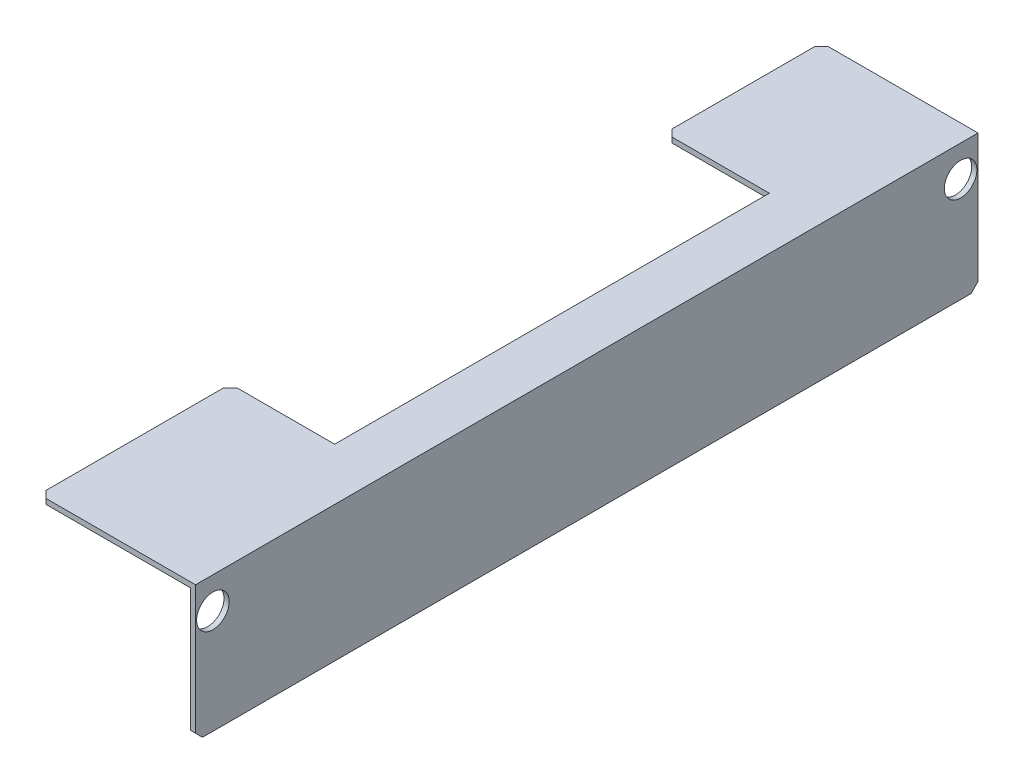
ISO-10303-21;
HEADER;
FILE_DESCRIPTION(('STEP AP214'),'2;1');
FILE_NAME('part.step','',(''),(''),'','','');
FILE_SCHEMA(('AUTOMOTIVE_DESIGN { 1 0 10303 214 1 1 1 1 }'));
ENDSEC;
DATA;
#1=APPLICATION_CONTEXT('core data for automotive mechanical design processes');
#2=APPLICATION_PROTOCOL_DEFINITION('international standard','automotive_design',2000,#1);
#3=PRODUCT_CONTEXT('',#1,'mechanical');
#4=PRODUCT('Part','Part','',(#3));
#5=PRODUCT_RELATED_PRODUCT_CATEGORY('part','',(#4));
#6=PRODUCT_DEFINITION_FORMATION('','',#4);
#7=PRODUCT_DEFINITION_CONTEXT('part definition',#1,'design');
#8=PRODUCT_DEFINITION('design','',#6,#7);
#9=PRODUCT_DEFINITION_SHAPE('','',#8);
#10=(LENGTH_UNIT() NAMED_UNIT(*) SI_UNIT(.MILLI.,.METRE.));
#11=(NAMED_UNIT(*) PLANE_ANGLE_UNIT() SI_UNIT($,.RADIAN.));
#12=(NAMED_UNIT(*) SI_UNIT($,.STERADIAN.) SOLID_ANGLE_UNIT());
#13=UNCERTAINTY_MEASURE_WITH_UNIT(LENGTH_MEASURE(1.E-05),#10,'distance_accuracy_value','');
#14=(GEOMETRIC_REPRESENTATION_CONTEXT(3) GLOBAL_UNCERTAINTY_ASSIGNED_CONTEXT((#13)) GLOBAL_UNIT_ASSIGNED_CONTEXT((#10,
#11,#12)) REPRESENTATION_CONTEXT('',''));
#15=CARTESIAN_POINT('',(0.,0.,0.));
#16=DIRECTION('',(0.,0.,1.));
#17=DIRECTION('',(1.,0.,0.));
#18=AXIS2_PLACEMENT_3D('',#15,#16,#17);
#19=CARTESIAN_POINT('',(-39.7556390977443,18.8063909774436,225.));
#20=DIRECTION('',(1.,0.,0.));
#21=DIRECTION('',(0.,0.,-1.));
#22=AXIS2_PLACEMENT_3D('',#19,#20,#21);
#23=PLANE('',#22);
#24=DIRECTION('',(0.,0.,-1.));
#25=VECTOR('',#24,1.);
#26=CARTESIAN_POINT('',(-39.7556390977443,18.8063909774436,225.));
#27=LINE('',#26,#25);
#28=CARTESIAN_POINT('',(-39.7556390977443,18.8063909774436,43.0000000000001));
#29=VERTEX_POINT('',#28);
#30=CARTESIAN_POINT('',(-39.7556390977443,18.8063909774436,1.99999999999997));
#31=VERTEX_POINT('',#30);
#32=EDGE_CURVE('E218',#29,#31,#27,.T.);
#33=ORIENTED_EDGE('',*,*,#32,.F.);
#34=DIRECTION('',(0.,1.,0.));
#35=VECTOR('',#34,1.);
#36=CARTESIAN_POINT('',(-39.7556390977443,18.8063909774436,43.0000000000001));
#37=LINE('',#36,#35);
#38=CARTESIAN_POINT('',(-39.7556390977443,20.3063909774436,43.0000000000001));
#39=VERTEX_POINT('',#38);
#40=EDGE_CURVE('E232',#29,#39,#37,.T.);
#41=ORIENTED_EDGE('',*,*,#40,.T.);
#42=DIRECTION('',(0.,0.,-1.));
#43=VECTOR('',#42,1.);
#44=CARTESIAN_POINT('',(-39.7556390977443,20.3063909774436,225.));
#45=LINE('',#44,#43);
#46=CARTESIAN_POINT('',(-39.7556390977443,20.3063909774436,1.99999999999997));
#47=VERTEX_POINT('',#46);
#48=EDGE_CURVE('E196',#39,#47,#45,.T.);
#49=ORIENTED_EDGE('',*,*,#48,.T.);
#50=DIRECTION('',(0.,-1.,0.));
#51=VECTOR('',#50,1.);
#52=CARTESIAN_POINT('',(-39.7556390977443,18.8063909774436,1.99999999999997));
#53=LINE('',#52,#51);
#54=EDGE_CURVE('E222',#47,#31,#53,.T.);
#55=ORIENTED_EDGE('',*,*,#54,.T.);
#56=EDGE_LOOP('',(#33,#41,#49,#55));
#57=FACE_BOUND('',#56,.T.);
#58=ADVANCED_FACE('F33',(#57),#23,.F.);
#59=CARTESIAN_POINT('',(-39.7556390977443,20.3063909774436,223.));
#60=VERTEX_POINT('',#59);
#61=CARTESIAN_POINT('',(-39.7556390977443,20.3063909774436,172.));
#62=VERTEX_POINT('',#61);
#63=EDGE_CURVE('E204',#60,#62,#45,.T.);
#64=ORIENTED_EDGE('',*,*,#63,.T.);
#65=DIRECTION('',(0.,-1.,0.));
#66=VECTOR('',#65,1.);
#67=CARTESIAN_POINT('',(-39.7556390977443,18.8063909774436,172.));
#68=LINE('',#67,#66);
#69=CARTESIAN_POINT('',(-39.7556390977443,18.8063909774436,172.));
#70=VERTEX_POINT('',#69);
#71=EDGE_CURVE('E260',#62,#70,#68,.T.);
#72=ORIENTED_EDGE('',*,*,#71,.T.);
#73=CARTESIAN_POINT('',(-39.7556390977443,18.8063909774436,223.));
#74=VERTEX_POINT('',#73);
#75=EDGE_CURVE('E219',#74,#70,#27,.T.);
#76=ORIENTED_EDGE('',*,*,#75,.F.);
#77=DIRECTION('',(0.,1.,0.));
#78=VECTOR('',#77,1.);
#79=CARTESIAN_POINT('',(-39.7556390977443,18.8063909774436,223.));
#80=LINE('',#79,#78);
#81=EDGE_CURVE('E258',#74,#60,#80,.T.);
#82=ORIENTED_EDGE('',*,*,#81,.T.);
#83=EDGE_LOOP('',(#64,#72,#76,#82));
#84=FACE_BOUND('',#83,.T.);
#85=ADVANCED_FACE('F307',(#84),#23,.F.);
#86=CARTESIAN_POINT('',(3.74436090225566,18.8063909774436,225.));
#87=DIRECTION('',(0.,1.,0.));
#88=DIRECTION('',(-1.,0.,0.));
#89=AXIS2_PLACEMENT_3D('',#86,#87,#88);
#90=PLANE('',#89);
#91=DIRECTION('',(-1.,0.,0.));
#92=VECTOR('',#91,1.);
#93=CARTESIAN_POINT('',(3.74436090225554,18.8063909774436,45.));
#94=LINE('',#93,#92);
#95=CARTESIAN_POINT('',(-9.75563909774434,18.8063909774436,45.));
#96=VERTEX_POINT('',#95);
#97=CARTESIAN_POINT('',(-37.7556390977444,18.8063909774436,45.));
#98=VERTEX_POINT('',#97);
#99=EDGE_CURVE('E181',#96,#98,#94,.T.);
#100=ORIENTED_EDGE('',*,*,#99,.T.);
#101=DIRECTION('',(0.707106781186552,0.,0.707106781186543));
#102=VECTOR('',#101,1.);
#103=CARTESIAN_POINT('',(-39.7556390977443,18.8063909774436,43.0000000000001));
#104=LINE('',#103,#102);
#105=EDGE_CURVE('E251',#98,#29,#104,.F.);
#106=ORIENTED_EDGE('',*,*,#105,.T.);
#107=ORIENTED_EDGE('',*,*,#32,.T.);
#108=DIRECTION('',(0.707106781186552,0.,-0.707106781186543));
#109=VECTOR('',#108,1.);
#110=CARTESIAN_POINT('',(-39.7556390977443,18.8063909774436,1.99999999999997));
#111=LINE('',#110,#109);
#112=CARTESIAN_POINT('',(-37.7556390977443,18.8063909774436,0.));
#113=VERTEX_POINT('',#112);
#114=EDGE_CURVE('E249',#31,#113,#111,.T.);
#115=ORIENTED_EDGE('',*,*,#114,.T.);
#116=DIRECTION('',(1.,0.,0.));
#117=VECTOR('',#116,1.);
#118=CARTESIAN_POINT('',(3.74436090225566,18.8063909774436,0.));
#119=LINE('',#118,#117);
#120=CARTESIAN_POINT('',(3.74436090225566,18.8063909774436,0.));
#121=VERTEX_POINT('',#120);
#122=EDGE_CURVE('E184',#113,#121,#119,.T.);
#123=ORIENTED_EDGE('',*,*,#122,.T.);
#124=DIRECTION('',(0.,0.,-1.));
#125=VECTOR('',#124,1.);
#126=CARTESIAN_POINT('',(3.74436090225566,18.8063909774436,225.));
#127=LINE('',#126,#125);
#128=CARTESIAN_POINT('',(3.74436090225566,18.8063909774436,225.));
#129=VERTEX_POINT('',#128);
#130=EDGE_CURVE('E215',#129,#121,#127,.T.);
#131=ORIENTED_EDGE('',*,*,#130,.F.);
#132=DIRECTION('',(1.,0.,0.));
#133=VECTOR('',#132,1.);
#134=CARTESIAN_POINT('',(3.74436090225566,18.8063909774436,225.));
#135=LINE('',#134,#133);
#136=CARTESIAN_POINT('',(-37.7556390977444,18.8063909774436,225.));
#137=VERTEX_POINT('',#136);
#138=EDGE_CURVE('E185',#137,#129,#135,.T.);
#139=ORIENTED_EDGE('',*,*,#138,.F.);
#140=DIRECTION('',(0.707106781186543,0.,0.707106781186552));
#141=VECTOR('',#140,1.);
#142=CARTESIAN_POINT('',(-37.7556390977444,18.8063909774436,225.));
#143=LINE('',#142,#141);
#144=EDGE_CURVE('E245',#137,#74,#143,.F.);
#145=ORIENTED_EDGE('',*,*,#144,.T.);
#146=ORIENTED_EDGE('',*,*,#75,.T.);
#147=DIRECTION('',(-0.707106781186548,0.,0.707106781186548));
#148=VECTOR('',#147,1.);
#149=CARTESIAN_POINT('',(-37.7556390977444,18.8063909774436,170.));
#150=LINE('',#149,#148);
#151=CARTESIAN_POINT('',(-37.7556390977444,18.8063909774436,170.));
#152=VERTEX_POINT('',#151);
#153=EDGE_CURVE('E247',#70,#152,#150,.F.);
#154=ORIENTED_EDGE('',*,*,#153,.T.);
#155=DIRECTION('',(1.,0.,0.));
#156=VECTOR('',#155,1.);
#157=CARTESIAN_POINT('',(3.74436090225566,18.8063909774436,170.));
#158=LINE('',#157,#156);
#159=CARTESIAN_POINT('',(-9.75563909774433,18.8063909774436,170.));
#160=VERTEX_POINT('',#159);
#161=EDGE_CURVE('E177',#152,#160,#158,.T.);
#162=ORIENTED_EDGE('',*,*,#161,.T.);
#163=DIRECTION('',(0.,0.,-1.));
#164=VECTOR('',#163,1.);
#165=CARTESIAN_POINT('',(-9.75563909774432,18.8063909774436,225.));
#166=LINE('',#165,#164);
#167=EDGE_CURVE('E166',#160,#96,#166,.T.);
#168=ORIENTED_EDGE('',*,*,#167,.T.);
#169=EDGE_LOOP('',(#100,#106,#107,#115,#123,#131,#139,#145,#146,#154,#162,#168));
#170=FACE_BOUND('',#169,.T.);
#171=ADVANCED_FACE('F313',(#170),#90,.F.);
#172=CARTESIAN_POINT('',(3.74436090225566,-18.6936090225564,225.));
#173=DIRECTION('',(1.,0.,0.));
#174=DIRECTION('',(0.,1.,0.));
#175=AXIS2_PLACEMENT_3D('',#172,#173,#174);
#176=PLANE('',#175);
#177=CARTESIAN_POINT('',(3.74436090225566,11.3063909774436,220.));
#178=DIRECTION('',(-1.,0.,0.));
#179=DIRECTION('',(0.,-1.,0.));
#180=AXIS2_PLACEMENT_3D('',#177,#178,#179);
#181=CIRCLE('',#180,4.68734361890242);
#182=CARTESIAN_POINT('',(3.74436090225566,6.61904735854118,220.));
#183=VERTEX_POINT('',#182);
#184=EDGE_CURVE('E229',#183,#183,#181,.T.);
#185=ORIENTED_EDGE('',*,*,#184,.F.);
#186=EDGE_LOOP('',(#185));
#187=FACE_BOUND('',#186,.T.);
#188=CARTESIAN_POINT('',(3.74436090225566,11.3063909774436,5.));
#189=DIRECTION('',(-1.,0.,0.));
#190=DIRECTION('',(0.,-1.,0.));
#191=AXIS2_PLACEMENT_3D('',#188,#189,#190);
#192=CIRCLE('',#191,4.68734361890242);
#193=CARTESIAN_POINT('',(3.74436090225566,6.61904735854119,5.));
#194=VERTEX_POINT('',#193);
#195=EDGE_CURVE('E225',#194,#194,#192,.T.);
#196=ORIENTED_EDGE('',*,*,#195,.F.);
#197=EDGE_LOOP('',(#196));
#198=FACE_BOUND('',#197,.T.);
#199=DIRECTION('',(0.,0.,-1.));
#200=VECTOR('',#199,1.);
#201=CARTESIAN_POINT('',(3.74436090225566,-18.6936090225564,225.));
#202=LINE('',#201,#200);
#203=CARTESIAN_POINT('',(3.74436090225566,-18.6936090225564,223.));
#204=VERTEX_POINT('',#203);
#205=CARTESIAN_POINT('',(3.74436090225566,-18.6936090225564,1.99999999999997));
#206=VERTEX_POINT('',#205);
#207=EDGE_CURVE('E213',#204,#206,#202,.T.);
#208=ORIENTED_EDGE('',*,*,#207,.F.);
#209=DIRECTION('',(0.,-0.707106781186548,-0.707106781186548));
#210=VECTOR('',#209,1.);
#211=CARTESIAN_POINT('',(3.74436090225566,-16.6936090225564,225.));
#212=LINE('',#211,#210);
#213=CARTESIAN_POINT('',(3.74436090225566,-16.6936090225564,225.));
#214=VERTEX_POINT('',#213);
#215=EDGE_CURVE('E11',#204,#214,#212,.F.);
#216=ORIENTED_EDGE('',*,*,#215,.T.);
#217=DIRECTION('',(0.,-1.,0.));
#218=VECTOR('',#217,1.);
#219=CARTESIAN_POINT('',(3.74436090225566,-18.6936090225564,225.));
#220=LINE('',#219,#218);
#221=EDGE_CURVE('E187',#129,#214,#220,.T.);
#222=ORIENTED_EDGE('',*,*,#221,.F.);
#223=ORIENTED_EDGE('',*,*,#130,.T.);
#224=DIRECTION('',(0.,-1.,0.));
#225=VECTOR('',#224,1.);
#226=CARTESIAN_POINT('',(3.74436090225566,-18.6936090225564,0.));
#227=LINE('',#226,#225);
#228=CARTESIAN_POINT('',(3.74436090225566,-16.6936090225564,0.));
#229=VERTEX_POINT('',#228);
#230=EDGE_CURVE('E198',#121,#229,#227,.T.);
#231=ORIENTED_EDGE('',*,*,#230,.T.);
#232=DIRECTION('',(0.,-0.707106781186552,0.707106781186543));
#233=VECTOR('',#232,1.);
#234=CARTESIAN_POINT('',(3.74436090225566,-18.6936090225564,1.99999999999997));
#235=LINE('',#234,#233);
#236=EDGE_CURVE('E41',#229,#206,#235,.T.);
#237=ORIENTED_EDGE('',*,*,#236,.T.);
#238=EDGE_LOOP('',(#208,#216,#222,#223,#231,#237));
#239=FACE_BOUND('',#238,.T.);
#240=ADVANCED_FACE('F292',(#187,#198,#239),#176,.F.);
#241=CARTESIAN_POINT('',(5.24436090225566,-18.6936090225564,225.));
#242=DIRECTION('',(0.,1.,0.));
#243=DIRECTION('',(0.,0.,1.));
#244=AXIS2_PLACEMENT_3D('',#241,#242,#243);
#245=PLANE('',#244);
#246=DIRECTION('',(0.,0.,-1.));
#247=VECTOR('',#246,1.);
#248=CARTESIAN_POINT('',(5.24436090225566,-18.6936090225564,225.));
#249=LINE('',#248,#247);
#250=CARTESIAN_POINT('',(5.24436090225566,-18.6936090225564,223.));
#251=VERTEX_POINT('',#250);
#252=CARTESIAN_POINT('',(5.24436090225566,-18.6936090225564,1.99999999999997));
#253=VERTEX_POINT('',#252);
#254=EDGE_CURVE('E210',#251,#253,#249,.T.);
#255=ORIENTED_EDGE('',*,*,#254,.F.);
#256=DIRECTION('',(-1.,0.,0.));
#257=VECTOR('',#256,1.);
#258=CARTESIAN_POINT('',(5.24436090225566,-18.6936090225564,223.));
#259=LINE('',#258,#257);
#260=EDGE_CURVE('E54',#251,#204,#259,.T.);
#261=ORIENTED_EDGE('',*,*,#260,.T.);
#262=ORIENTED_EDGE('',*,*,#207,.T.);
#263=DIRECTION('',(1.,0.,0.));
#264=VECTOR('',#263,1.);
#265=CARTESIAN_POINT('',(5.24436090225566,-18.6936090225564,1.99999999999997));
#266=LINE('',#265,#264);
#267=EDGE_CURVE('E272',#206,#253,#266,.T.);
#268=ORIENTED_EDGE('',*,*,#267,.T.);
#269=EDGE_LOOP('',(#255,#261,#262,#268));
#270=FACE_BOUND('',#269,.T.);
#271=ADVANCED_FACE('F276',(#270),#245,.F.);
#272=CARTESIAN_POINT('',(5.24436090225566,20.3063909774436,225.));
#273=DIRECTION('',(-1.,0.,0.));
#274=DIRECTION('',(0.,-1.,0.));
#275=AXIS2_PLACEMENT_3D('',#272,#273,#274);
#276=PLANE('',#275);
#277=CARTESIAN_POINT('',(5.24436090225566,11.3063909774436,220.));
#278=DIRECTION('',(-1.,0.,0.));
#279=DIRECTION('',(0.,-1.,0.));
#280=AXIS2_PLACEMENT_3D('',#277,#278,#279);
#281=CIRCLE('',#280,4.68734361890242);
#282=CARTESIAN_POINT('',(5.24436090225566,6.61904735854118,220.));
#283=VERTEX_POINT('',#282);
#284=EDGE_CURVE('E226',#283,#283,#281,.T.);
#285=ORIENTED_EDGE('',*,*,#284,.T.);
#286=EDGE_LOOP('',(#285));
#287=FACE_BOUND('',#286,.T.);
#288=CARTESIAN_POINT('',(5.24436090225566,11.3063909774436,5.));
#289=DIRECTION('',(-1.,0.,0.));
#290=DIRECTION('',(0.,-1.,0.));
#291=AXIS2_PLACEMENT_3D('',#288,#289,#290);
#292=CIRCLE('',#291,4.68734361890242);
#293=CARTESIAN_POINT('',(5.24436090225566,6.61904735854119,5.));
#294=VERTEX_POINT('',#293);
#295=EDGE_CURVE('E157',#294,#294,#292,.T.);
#296=ORIENTED_EDGE('',*,*,#295,.T.);
#297=EDGE_LOOP('',(#296));
#298=FACE_BOUND('',#297,.T.);
#299=DIRECTION('',(0.,1.,0.));
#300=VECTOR('',#299,1.);
#301=CARTESIAN_POINT('',(5.24436090225566,20.3063909774436,225.));
#302=LINE('',#301,#300);
#303=CARTESIAN_POINT('',(5.24436090225566,-16.6936090225564,225.));
#304=VERTEX_POINT('',#303);
#305=CARTESIAN_POINT('',(5.24436090225566,20.3063909774436,225.));
#306=VERTEX_POINT('',#305);
#307=EDGE_CURVE('E191',#304,#306,#302,.T.);
#308=ORIENTED_EDGE('',*,*,#307,.F.);
#309=DIRECTION('',(0.,0.707106781186548,0.707106781186548));
#310=VECTOR('',#309,1.);
#311=CARTESIAN_POINT('',(5.24436090225566,-16.6936090225564,225.));
#312=LINE('',#311,#310);
#313=EDGE_CURVE('E270',#304,#251,#312,.F.);
#314=ORIENTED_EDGE('',*,*,#313,.T.);
#315=ORIENTED_EDGE('',*,*,#254,.T.);
#316=DIRECTION('',(0.,0.707106781186552,-0.707106781186543));
#317=VECTOR('',#316,1.);
#318=CARTESIAN_POINT('',(5.24436090225566,-18.6936090225564,1.99999999999997));
#319=LINE('',#318,#317);
#320=CARTESIAN_POINT('',(5.24436090225566,-16.6936090225564,0.));
#321=VERTEX_POINT('',#320);
#322=EDGE_CURVE('E268',#253,#321,#319,.T.);
#323=ORIENTED_EDGE('',*,*,#322,.T.);
#324=DIRECTION('',(0.,1.,0.));
#325=VECTOR('',#324,1.);
#326=CARTESIAN_POINT('',(5.24436090225566,20.3063909774436,0.));
#327=LINE('',#326,#325);
#328=CARTESIAN_POINT('',(5.24436090225566,20.3063909774436,0.));
#329=VERTEX_POINT('',#328);
#330=EDGE_CURVE('E200',#321,#329,#327,.T.);
#331=ORIENTED_EDGE('',*,*,#330,.T.);
#332=DIRECTION('',(0.,0.,-1.));
#333=VECTOR('',#332,1.);
#334=CARTESIAN_POINT('',(5.24436090225566,20.3063909774436,225.));
#335=LINE('',#334,#333);
#336=EDGE_CURVE('E207',#306,#329,#335,.T.);
#337=ORIENTED_EDGE('',*,*,#336,.F.);
#338=EDGE_LOOP('',(#308,#314,#315,#323,#331,#337));
#339=FACE_BOUND('',#338,.T.);
#340=ADVANCED_FACE('F280',(#287,#298,#339),#276,.F.);
#341=CARTESIAN_POINT('',(-39.7556390977443,20.3063909774436,225.));
#342=DIRECTION('',(0.,-1.,0.));
#343=DIRECTION('',(0.,0.,-1.));
#344=AXIS2_PLACEMENT_3D('',#341,#342,#343);
#345=PLANE('',#344);
#346=ORIENTED_EDGE('',*,*,#48,.F.);
#347=DIRECTION('',(-0.707106781186552,0.,-0.707106781186543));
#348=VECTOR('',#347,1.);
#349=CARTESIAN_POINT('',(-39.7556390977443,20.3063909774436,43.0000000000001));
#350=LINE('',#349,#348);
#351=CARTESIAN_POINT('',(-37.7556390977444,20.3063909774436,45.));
#352=VERTEX_POINT('',#351);
#353=EDGE_CURVE('E241',#39,#352,#350,.F.);
#354=ORIENTED_EDGE('',*,*,#353,.T.);
#355=DIRECTION('',(-1.,0.,0.));
#356=VECTOR('',#355,1.);
#357=CARTESIAN_POINT('',(-39.7556390977443,20.3063909774436,45.));
#358=LINE('',#357,#356);
#359=CARTESIAN_POINT('',(-9.75563909774434,20.3063909774436,45.));
#360=VERTEX_POINT('',#359);
#361=EDGE_CURVE('E168',#360,#352,#358,.T.);
#362=ORIENTED_EDGE('',*,*,#361,.F.);
#363=DIRECTION('',(0.,0.,-1.));
#364=VECTOR('',#363,1.);
#365=CARTESIAN_POINT('',(-9.75563909774434,20.3063909774436,45.));
#366=LINE('',#365,#364);
#367=CARTESIAN_POINT('',(-9.75563909774433,20.3063909774436,170.));
#368=VERTEX_POINT('',#367);
#369=EDGE_CURVE('E156',#368,#360,#366,.T.);
#370=ORIENTED_EDGE('',*,*,#369,.F.);
#371=DIRECTION('',(1.,0.,0.));
#372=VECTOR('',#371,1.);
#373=CARTESIAN_POINT('',(-39.7556390977443,20.3063909774436,170.));
#374=LINE('',#373,#372);
#375=CARTESIAN_POINT('',(-37.7556390977444,20.3063909774436,170.));
#376=VERTEX_POINT('',#375);
#377=EDGE_CURVE('E147',#376,#368,#374,.T.);
#378=ORIENTED_EDGE('',*,*,#377,.F.);
#379=DIRECTION('',(0.707106781186548,0.,-0.707106781186548));
#380=VECTOR('',#379,1.);
#381=CARTESIAN_POINT('',(-37.7556390977444,20.3063909774436,170.));
#382=LINE('',#381,#380);
#383=EDGE_CURVE('E237',#376,#62,#382,.F.);
#384=ORIENTED_EDGE('',*,*,#383,.T.);
#385=ORIENTED_EDGE('',*,*,#63,.F.);
#386=DIRECTION('',(-0.707106781186543,0.,-0.707106781186552));
#387=VECTOR('',#386,1.);
#388=CARTESIAN_POINT('',(-37.7556390977444,20.3063909774436,225.));
#389=LINE('',#388,#387);
#390=CARTESIAN_POINT('',(-37.7556390977444,20.3063909774436,225.));
#391=VERTEX_POINT('',#390);
#392=EDGE_CURVE('E235',#60,#391,#389,.F.);
#393=ORIENTED_EDGE('',*,*,#392,.T.);
#394=DIRECTION('',(-1.,0.,0.));
#395=VECTOR('',#394,1.);
#396=CARTESIAN_POINT('',(-39.7556390977443,20.3063909774436,225.));
#397=LINE('',#396,#395);
#398=EDGE_CURVE('E193',#306,#391,#397,.T.);
#399=ORIENTED_EDGE('',*,*,#398,.F.);
#400=ORIENTED_EDGE('',*,*,#336,.T.);
#401=DIRECTION('',(-1.,0.,0.));
#402=VECTOR('',#401,1.);
#403=CARTESIAN_POINT('',(-39.7556390977443,20.3063909774436,0.));
#404=LINE('',#403,#402);
#405=CARTESIAN_POINT('',(-37.7556390977443,20.3063909774436,0.));
#406=VERTEX_POINT('',#405);
#407=EDGE_CURVE('E188',#329,#406,#404,.T.);
#408=ORIENTED_EDGE('',*,*,#407,.T.);
#409=DIRECTION('',(-0.707106781186552,0.,0.707106781186543));
#410=VECTOR('',#409,1.);
#411=CARTESIAN_POINT('',(-39.7556390977443,20.3063909774436,1.99999999999997));
#412=LINE('',#411,#410);
#413=EDGE_CURVE('E239',#406,#47,#412,.T.);
#414=ORIENTED_EDGE('',*,*,#413,.T.);
#415=EDGE_LOOP('',(#346,#354,#362,#370,#378,#384,#385,#393,#399,#400,#408,#414));
#416=FACE_BOUND('',#415,.T.);
#417=ADVANCED_FACE('F171',(#416),#345,.F.);
#418=CARTESIAN_POINT('',(0.,0.,225.));
#419=DIRECTION('',(0.,0.,-1.));
#420=DIRECTION('',(-1.,0.,0.));
#421=AXIS2_PLACEMENT_3D('',#418,#419,#420);
#422=PLANE('',#421);
#423=ORIENTED_EDGE('',*,*,#398,.T.);
#424=DIRECTION('',(0.,-1.,0.));
#425=VECTOR('',#424,1.);
#426=CARTESIAN_POINT('',(-37.7556390977444,0.,225.));
#427=LINE('',#426,#425);
#428=EDGE_CURVE('E265',#391,#137,#427,.T.);
#429=ORIENTED_EDGE('',*,*,#428,.T.);
#430=ORIENTED_EDGE('',*,*,#138,.T.);
#431=ORIENTED_EDGE('',*,*,#221,.T.);
#432=DIRECTION('',(1.,0.,0.));
#433=VECTOR('',#432,1.);
#434=CARTESIAN_POINT('',(0.,-16.6936090225564,225.));
#435=LINE('',#434,#433);
#436=EDGE_CURVE('E262',#214,#304,#435,.T.);
#437=ORIENTED_EDGE('',*,*,#436,.T.);
#438=ORIENTED_EDGE('',*,*,#307,.T.);
#439=EDGE_LOOP('',(#423,#429,#430,#431,#437,#438));
#440=FACE_BOUND('',#439,.T.);
#441=ADVANCED_FACE('F288',(#440),#422,.F.);
#442=CARTESIAN_POINT('',(0.,0.,0.));
#443=DIRECTION('',(0.,0.,-1.));
#444=DIRECTION('',(-1.,0.,0.));
#445=AXIS2_PLACEMENT_3D('',#442,#443,#444);
#446=PLANE('',#445);
#447=ORIENTED_EDGE('',*,*,#122,.F.);
#448=DIRECTION('',(0.,1.,0.));
#449=VECTOR('',#448,1.);
#450=CARTESIAN_POINT('',(-37.7556390977443,20.3063909774436,0.));
#451=LINE('',#450,#449);
#452=EDGE_CURVE('E255',#113,#406,#451,.T.);
#453=ORIENTED_EDGE('',*,*,#452,.T.);
#454=ORIENTED_EDGE('',*,*,#407,.F.);
#455=ORIENTED_EDGE('',*,*,#330,.F.);
#456=DIRECTION('',(-1.,0.,0.));
#457=VECTOR('',#456,1.);
#458=CARTESIAN_POINT('',(3.74436090225566,-16.6936090225564,0.));
#459=LINE('',#458,#457);
#460=EDGE_CURVE('E253',#321,#229,#459,.T.);
#461=ORIENTED_EDGE('',*,*,#460,.T.);
#462=ORIENTED_EDGE('',*,*,#230,.F.);
#463=EDGE_LOOP('',(#447,#453,#454,#455,#461,#462));
#464=FACE_BOUND('',#463,.T.);
#465=ADVANCED_FACE('F297',(#464),#446,.T.);
#466=CARTESIAN_POINT('',(-39.7556390977443,-204.693609022556,45.));
#467=DIRECTION('',(0.,0.,-1.));
#468=DIRECTION('',(-1.,0.,0.));
#469=AXIS2_PLACEMENT_3D('',#466,#467,#468);
#470=PLANE('',#469);
#471=ORIENTED_EDGE('',*,*,#361,.T.);
#472=DIRECTION('',(0.,-1.,0.));
#473=VECTOR('',#472,1.);
#474=CARTESIAN_POINT('',(-37.7556390977444,-204.693609022556,45.));
#475=LINE('',#474,#473);
#476=EDGE_CURVE('E243',#352,#98,#475,.T.);
#477=ORIENTED_EDGE('',*,*,#476,.T.);
#478=ORIENTED_EDGE('',*,*,#99,.F.);
#479=DIRECTION('',(0.,1.,0.));
#480=VECTOR('',#479,1.);
#481=CARTESIAN_POINT('',(-9.75563909774434,-204.693609022556,45.));
#482=LINE('',#481,#480);
#483=EDGE_CURVE('E167',#96,#360,#482,.T.);
#484=ORIENTED_EDGE('',*,*,#483,.T.);
#485=EDGE_LOOP('',(#471,#477,#478,#484));
#486=FACE_BOUND('',#485,.T.);
#487=ADVANCED_FACE('F352',(#486),#470,.F.);
#488=CARTESIAN_POINT('',(-9.75563909774434,-204.693609022556,45.));
#489=DIRECTION('',(1.,0.,0.));
#490=DIRECTION('',(0.,0.,-1.));
#491=AXIS2_PLACEMENT_3D('',#488,#489,#490);
#492=PLANE('',#491);
#493=DIRECTION('',(0.,1.,0.));
#494=VECTOR('',#493,1.);
#495=CARTESIAN_POINT('',(-9.75563909774433,-204.693609022556,170.));
#496=LINE('',#495,#494);
#497=EDGE_CURVE('E151',#160,#368,#496,.T.);
#498=ORIENTED_EDGE('',*,*,#497,.T.);
#499=ORIENTED_EDGE('',*,*,#369,.T.);
#500=ORIENTED_EDGE('',*,*,#483,.F.);
#501=ORIENTED_EDGE('',*,*,#167,.F.);
#502=EDGE_LOOP('',(#498,#499,#500,#501));
#503=FACE_BOUND('',#502,.T.);
#504=ADVANCED_FACE('F162',(#503),#492,.F.);
#505=CARTESIAN_POINT('',(-39.7556390977443,-204.693609022556,170.));
#506=DIRECTION('',(0.,0.,1.));
#507=DIRECTION('',(1.,0.,0.));
#508=AXIS2_PLACEMENT_3D('',#505,#506,#507);
#509=PLANE('',#508);
#510=ORIENTED_EDGE('',*,*,#161,.F.);
#511=DIRECTION('',(0.,1.,0.));
#512=VECTOR('',#511,1.);
#513=CARTESIAN_POINT('',(-37.7556390977444,-204.693609022556,170.));
#514=LINE('',#513,#512);
#515=EDGE_CURVE('E153',#152,#376,#514,.T.);
#516=ORIENTED_EDGE('',*,*,#515,.T.);
#517=ORIENTED_EDGE('',*,*,#377,.T.);
#518=ORIENTED_EDGE('',*,*,#497,.F.);
#519=EDGE_LOOP('',(#510,#516,#517,#518));
#520=FACE_BOUND('',#519,.T.);
#521=ADVANCED_FACE('F150',(#520),#509,.F.);
#522=CARTESIAN_POINT('',(228.744360902256,11.3063909774436,5.));
#523=DIRECTION('',(-1.,0.,0.));
#524=DIRECTION('',(0.,-1.,0.));
#525=AXIS2_PLACEMENT_3D('',#522,#523,#524);
#526=CYLINDRICAL_SURFACE('',#525,4.68734361890242);
#527=ORIENTED_EDGE('',*,*,#195,.T.);
#528=EDGE_LOOP('',(#527));
#529=FACE_BOUND('',#528,.T.);
#530=ORIENTED_EDGE('',*,*,#295,.F.);
#531=EDGE_LOOP('',(#530));
#532=FACE_BOUND('',#531,.T.);
#533=ADVANCED_FACE('F362',(#529,#532),#526,.F.);
#534=CARTESIAN_POINT('',(228.744360902256,11.3063909774436,220.));
#535=DIRECTION('',(-1.,0.,0.));
#536=DIRECTION('',(0.,-1.,0.));
#537=AXIS2_PLACEMENT_3D('',#534,#535,#536);
#538=CYLINDRICAL_SURFACE('',#537,4.68734361890242);
#539=ORIENTED_EDGE('',*,*,#184,.T.);
#540=EDGE_LOOP('',(#539));
#541=FACE_BOUND('',#540,.T.);
#542=ORIENTED_EDGE('',*,*,#284,.F.);
#543=EDGE_LOOP('',(#542));
#544=FACE_BOUND('',#543,.T.);
#545=ADVANCED_FACE('F323',(#541,#544),#538,.F.);
#546=CARTESIAN_POINT('',(-39.7556390977443,18.8063909774436,43.0000000000001));
#547=DIRECTION('',(0.707106781186543,0.,-0.707106781186552));
#548=DIRECTION('',(0.,1.,0.));
#549=AXIS2_PLACEMENT_3D('',#546,#547,#548);
#550=PLANE('',#549);
#551=ORIENTED_EDGE('',*,*,#105,.F.);
#552=ORIENTED_EDGE('',*,*,#476,.F.);
#553=ORIENTED_EDGE('',*,*,#353,.F.);
#554=ORIENTED_EDGE('',*,*,#40,.F.);
#555=EDGE_LOOP('',(#551,#552,#553,#554));
#556=FACE_BOUND('',#555,.T.);
#557=ADVANCED_FACE('F319',(#556),#550,.F.);
#558=CARTESIAN_POINT('',(-39.7556390977443,18.8063909774436,1.99999999999997));
#559=DIRECTION('',(-0.707106781186543,0.,-0.707106781186552));
#560=DIRECTION('',(0.,1.,0.));
#561=AXIS2_PLACEMENT_3D('',#558,#559,#560);
#562=PLANE('',#561);
#563=ORIENTED_EDGE('',*,*,#413,.F.);
#564=ORIENTED_EDGE('',*,*,#452,.F.);
#565=ORIENTED_EDGE('',*,*,#114,.F.);
#566=ORIENTED_EDGE('',*,*,#54,.F.);
#567=EDGE_LOOP('',(#563,#564,#565,#566));
#568=FACE_BOUND('',#567,.T.);
#569=ADVANCED_FACE('F322',(#568),#562,.T.);
#570=CARTESIAN_POINT('',(-37.7556390977444,-204.693609022556,170.));
#571=DIRECTION('',(0.707106781186547,0.,0.707106781186547));
#572=DIRECTION('',(0.,1.,0.));
#573=AXIS2_PLACEMENT_3D('',#570,#571,#572);
#574=PLANE('',#573);
#575=ORIENTED_EDGE('',*,*,#153,.F.);
#576=ORIENTED_EDGE('',*,*,#71,.F.);
#577=ORIENTED_EDGE('',*,*,#383,.F.);
#578=ORIENTED_EDGE('',*,*,#515,.F.);
#579=EDGE_LOOP('',(#575,#576,#577,#578));
#580=FACE_BOUND('',#579,.T.);
#581=ADVANCED_FACE('F327',(#580),#574,.F.);
#582=CARTESIAN_POINT('',(-37.7556390977444,0.,225.));
#583=DIRECTION('',(0.707106781186552,0.,-0.707106781186543));
#584=DIRECTION('',(0.,-1.,0.));
#585=AXIS2_PLACEMENT_3D('',#582,#583,#584);
#586=PLANE('',#585);
#587=ORIENTED_EDGE('',*,*,#392,.F.);
#588=ORIENTED_EDGE('',*,*,#81,.F.);
#589=ORIENTED_EDGE('',*,*,#144,.F.);
#590=ORIENTED_EDGE('',*,*,#428,.F.);
#591=EDGE_LOOP('',(#587,#588,#589,#590));
#592=FACE_BOUND('',#591,.T.);
#593=ADVANCED_FACE('F305',(#592),#586,.F.);
#594=CARTESIAN_POINT('',(0.,-16.6936090225564,225.));
#595=DIRECTION('',(0.,0.707106781186547,-0.707106781186547));
#596=DIRECTION('',(1.,0.,0.));
#597=AXIS2_PLACEMENT_3D('',#594,#595,#596);
#598=PLANE('',#597);
#599=ORIENTED_EDGE('',*,*,#215,.F.);
#600=ORIENTED_EDGE('',*,*,#260,.F.);
#601=ORIENTED_EDGE('',*,*,#313,.F.);
#602=ORIENTED_EDGE('',*,*,#436,.F.);
#603=EDGE_LOOP('',(#599,#600,#601,#602));
#604=FACE_BOUND('',#603,.T.);
#605=ADVANCED_FACE('F286',(#604),#598,.F.);
#606=CARTESIAN_POINT('',(5.24436090225566,-18.6936090225564,1.99999999999997));
#607=DIRECTION('',(0.,-0.707106781186543,-0.707106781186552));
#608=DIRECTION('',(-1.,0.,0.));
#609=AXIS2_PLACEMENT_3D('',#606,#607,#608);
#610=PLANE('',#609);
#611=ORIENTED_EDGE('',*,*,#236,.F.);
#612=ORIENTED_EDGE('',*,*,#460,.F.);
#613=ORIENTED_EDGE('',*,*,#322,.F.);
#614=ORIENTED_EDGE('',*,*,#267,.F.);
#615=EDGE_LOOP('',(#611,#612,#613,#614));
#616=FACE_BOUND('',#615,.T.);
#617=ADVANCED_FACE('F35',(#616),#610,.T.);
#618=CLOSED_SHELL('',(#58,#85,#171,#240,#271,#340,#417,#441,#465,#487,#504,#521,#533,#545,#557,
#569,#581,#593,#605,#617));
#619=MANIFOLD_SOLID_BREP('B2',#618);
#620=ADVANCED_BREP_SHAPE_REPRESENTATION('',(#18,#619),#14);
#621=SHAPE_DEFINITION_REPRESENTATION(#9,#620);
ENDSEC;
END-ISO-10303-21;
